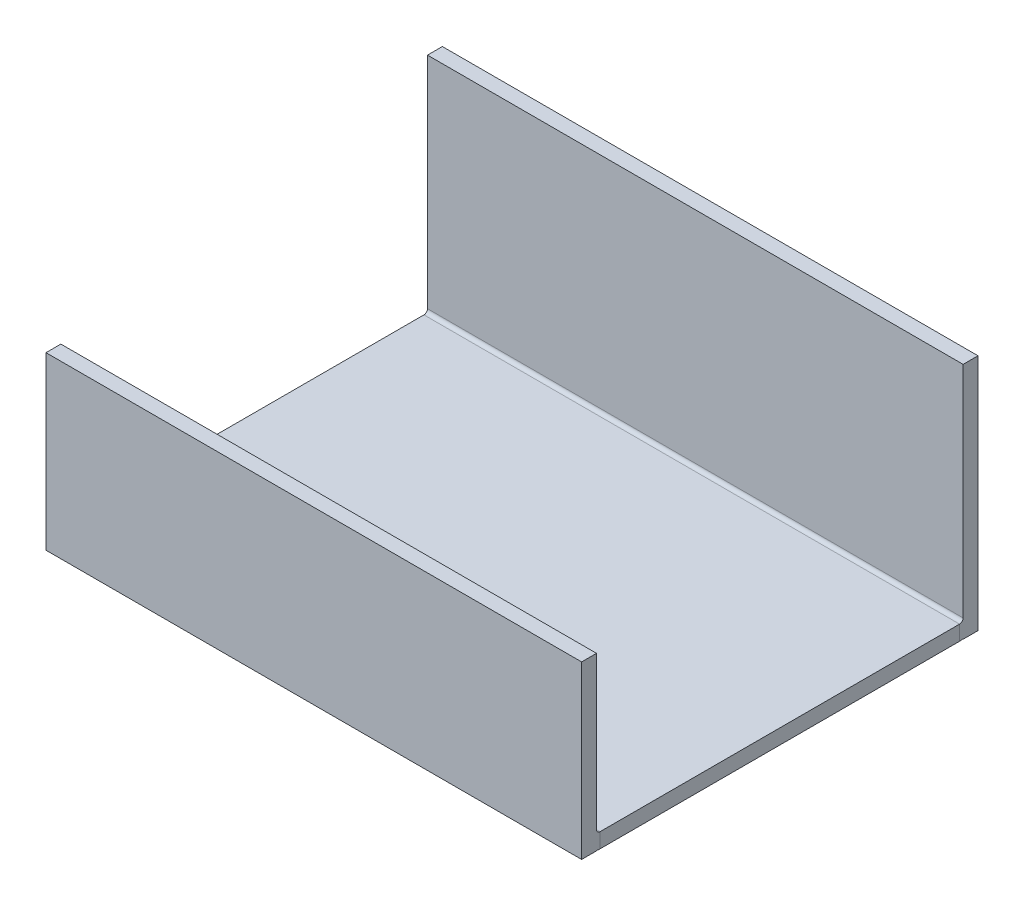
ISO-10303-21;
HEADER;
FILE_DESCRIPTION(('STEP AP214'),'2;1');
FILE_NAME('part.step','',(''),(''),'','','');
FILE_SCHEMA(('AUTOMOTIVE_DESIGN { 1 0 10303 214 1 1 1 1 }'));
ENDSEC;
DATA;
#1=APPLICATION_CONTEXT('core data for automotive mechanical design processes');
#2=APPLICATION_PROTOCOL_DEFINITION('international standard','automotive_design',2000,#1);
#3=PRODUCT_CONTEXT('',#1,'mechanical');
#4=PRODUCT('Part','Part','',(#3));
#5=PRODUCT_RELATED_PRODUCT_CATEGORY('part','',(#4));
#6=PRODUCT_DEFINITION_FORMATION('','',#4);
#7=PRODUCT_DEFINITION_CONTEXT('part definition',#1,'design');
#8=PRODUCT_DEFINITION('design','',#6,#7);
#9=PRODUCT_DEFINITION_SHAPE('','',#8);
#10=(LENGTH_UNIT() NAMED_UNIT(*) SI_UNIT(.MILLI.,.METRE.));
#11=(NAMED_UNIT(*) PLANE_ANGLE_UNIT() SI_UNIT($,.RADIAN.));
#12=(NAMED_UNIT(*) SI_UNIT($,.STERADIAN.) SOLID_ANGLE_UNIT());
#13=UNCERTAINTY_MEASURE_WITH_UNIT(LENGTH_MEASURE(1.E-05),#10,'distance_accuracy_value','');
#14=(GEOMETRIC_REPRESENTATION_CONTEXT(3) GLOBAL_UNCERTAINTY_ASSIGNED_CONTEXT((#13)) GLOBAL_UNIT_ASSIGNED_CONTEXT((#10,
#11,#12)) REPRESENTATION_CONTEXT('',''));
#15=CARTESIAN_POINT('',(0.,0.,0.));
#16=DIRECTION('',(0.,0.,1.));
#17=DIRECTION('',(1.,0.,0.));
#18=AXIS2_PLACEMENT_3D('',#15,#16,#17);
#19=CARTESIAN_POINT('',(0.,3.175,-78.232));
#20=DIRECTION('',(0.,-1.,0.));
#21=DIRECTION('',(0.,0.,-1.));
#22=AXIS2_PLACEMENT_3D('',#19,#20,#21);
#23=PLANE('',#22);
#24=DIRECTION('',(1.,0.,0.));
#25=VECTOR('',#24,1.);
#26=CARTESIAN_POINT('',(114.3,3.175,-0.761999999999999));
#27=LINE('',#26,#25);
#28=CARTESIAN_POINT('',(114.3,3.175,-0.761999999999999));
#29=VERTEX_POINT('',#28);
#30=CARTESIAN_POINT('',(0.,3.175,-0.761999999999999));
#31=VERTEX_POINT('',#30);
#32=EDGE_CURVE('E248',#29,#31,#27,.F.);
#33=ORIENTED_EDGE('',*,*,#32,.F.);
#34=DIRECTION('',(0.,0.,-1.));
#35=VECTOR('',#34,1.);
#36=CARTESIAN_POINT('',(114.3,3.175,0.));
#37=LINE('',#36,#35);
#38=CARTESIAN_POINT('',(114.3,3.17499999999999,-77.47));
#39=VERTEX_POINT('',#38);
#40=EDGE_CURVE('E11',#29,#39,#37,.T.);
#41=ORIENTED_EDGE('',*,*,#40,.T.);
#42=DIRECTION('',(-1.,0.,0.));
#43=VECTOR('',#42,1.);
#44=CARTESIAN_POINT('',(0.,3.17499999999999,-77.47));
#45=LINE('',#44,#43);
#46=CARTESIAN_POINT('',(0.,3.17499999999999,-77.47));
#47=VERTEX_POINT('',#46);
#48=EDGE_CURVE('E277',#47,#39,#45,.F.);
#49=ORIENTED_EDGE('',*,*,#48,.F.);
#50=DIRECTION('',(0.,0.,1.));
#51=VECTOR('',#50,1.);
#52=CARTESIAN_POINT('',(0.,3.175,0.));
#53=LINE('',#52,#51);
#54=EDGE_CURVE('E48',#47,#31,#53,.T.);
#55=ORIENTED_EDGE('',*,*,#54,.T.);
#56=EDGE_LOOP('',(#33,#41,#49,#55));
#57=FACE_BOUND('',#56,.T.);
#58=ADVANCED_FACE('F39',(#57),#23,.F.);
#59=CARTESIAN_POINT('',(0.,0.,-78.232));
#60=DIRECTION('',(0.,-1.,0.));
#61=DIRECTION('',(0.,0.,-1.));
#62=AXIS2_PLACEMENT_3D('',#59,#60,#61);
#63=PLANE('',#62);
#64=DIRECTION('',(0.,0.,-1.));
#65=VECTOR('',#64,1.);
#66=CARTESIAN_POINT('',(114.3,0.,-78.232));
#67=LINE('',#66,#65);
#68=CARTESIAN_POINT('',(114.3,0.,-0.761999999999998));
#69=VERTEX_POINT('',#68);
#70=CARTESIAN_POINT('',(114.3,0.,-77.47));
#71=VERTEX_POINT('',#70);
#72=EDGE_CURVE('E43',#69,#71,#67,.T.);
#73=ORIENTED_EDGE('',*,*,#72,.F.);
#74=DIRECTION('',(1.,0.,0.));
#75=VECTOR('',#74,1.);
#76=CARTESIAN_POINT('',(114.3,0.,-0.761999999999998));
#77=LINE('',#76,#75);
#78=CARTESIAN_POINT('',(0.,0.,-0.761999999999998));
#79=VERTEX_POINT('',#78);
#80=EDGE_CURVE('E236',#69,#79,#77,.F.);
#81=ORIENTED_EDGE('',*,*,#80,.T.);
#82=DIRECTION('',(0.,0.,-1.));
#83=VECTOR('',#82,1.);
#84=CARTESIAN_POINT('',(0.,0.,-78.232));
#85=LINE('',#84,#83);
#86=CARTESIAN_POINT('',(0.,0.,-77.47));
#87=VERTEX_POINT('',#86);
#88=EDGE_CURVE('E284',#87,#79,#85,.F.);
#89=ORIENTED_EDGE('',*,*,#88,.F.);
#90=DIRECTION('',(-1.,0.,0.));
#91=VECTOR('',#90,1.);
#92=CARTESIAN_POINT('',(0.,0.,-77.47));
#93=LINE('',#92,#91);
#94=EDGE_CURVE('E268',#87,#71,#93,.F.);
#95=ORIENTED_EDGE('',*,*,#94,.T.);
#96=EDGE_LOOP('',(#73,#81,#89,#95));
#97=FACE_BOUND('',#96,.T.);
#98=ADVANCED_FACE('F299',(#97),#63,.T.);
#99=CARTESIAN_POINT('',(114.3,3.175,0.));
#100=DIRECTION('',(-1.,0.,0.));
#101=DIRECTION('',(0.,0.,-1.));
#102=AXIS2_PLACEMENT_3D('',#99,#100,#101);
#103=PLANE('',#102);
#104=ORIENTED_EDGE('',*,*,#40,.F.);
#105=DIRECTION('',(0.,-1.,0.));
#106=VECTOR('',#105,1.);
#107=CARTESIAN_POINT('',(114.3,3.175,-0.761999999999999));
#108=LINE('',#107,#106);
#109=EDGE_CURVE('E243',#29,#69,#108,.T.);
#110=ORIENTED_EDGE('',*,*,#109,.T.);
#111=ORIENTED_EDGE('',*,*,#72,.T.);
#112=DIRECTION('',(0.,-1.,0.));
#113=VECTOR('',#112,1.);
#114=CARTESIAN_POINT('',(114.3,3.17499999999999,-77.47));
#115=LINE('',#114,#113);
#116=EDGE_CURVE('E282',#39,#71,#115,.T.);
#117=ORIENTED_EDGE('',*,*,#116,.F.);
#118=EDGE_LOOP('',(#104,#110,#111,#117));
#119=FACE_BOUND('',#118,.T.);
#120=ADVANCED_FACE('F41',(#119),#103,.F.);
#121=CARTESIAN_POINT('',(0.,3.175,0.));
#122=DIRECTION('',(1.,0.,0.));
#123=DIRECTION('',(0.,0.,1.));
#124=AXIS2_PLACEMENT_3D('',#121,#122,#123);
#125=PLANE('',#124);
#126=DIRECTION('',(0.,-1.,0.));
#127=VECTOR('',#126,1.);
#128=CARTESIAN_POINT('',(0.,3.175,-0.761999999999999));
#129=LINE('',#128,#127);
#130=EDGE_CURVE('E252',#31,#79,#129,.T.);
#131=ORIENTED_EDGE('',*,*,#130,.F.);
#132=ORIENTED_EDGE('',*,*,#54,.F.);
#133=DIRECTION('',(0.,-1.,0.));
#134=VECTOR('',#133,1.);
#135=CARTESIAN_POINT('',(0.,3.17499999999999,-77.47));
#136=LINE('',#135,#134);
#137=EDGE_CURVE('E272',#47,#87,#136,.T.);
#138=ORIENTED_EDGE('',*,*,#137,.T.);
#139=ORIENTED_EDGE('',*,*,#88,.T.);
#140=EDGE_LOOP('',(#131,#132,#138,#139));
#141=FACE_BOUND('',#140,.T.);
#142=ADVANCED_FACE('F308',(#141),#125,.F.);
#143=CARTESIAN_POINT('',(114.3,3.93699999999999,-77.47));
#144=DIRECTION('',(1.,0.,0.));
#145=DIRECTION('',(0.,0.,-1.));
#146=AXIS2_PLACEMENT_3D('',#143,#144,#145);
#147=PLANE('',#146);
#148=CARTESIAN_POINT('',(114.3,3.93699999999999,-77.47));
#149=DIRECTION('',(-1.,0.,0.));
#150=DIRECTION('',(0.,0.,1.));
#151=AXIS2_PLACEMENT_3D('',#148,#149,#150);
#152=CIRCLE('',#151,3.937);
#153=CARTESIAN_POINT('',(114.3,0.0744457932606198,-78.232));
#154=VERTEX_POINT('',#153);
#155=EDGE_CURVE('E158',#71,#154,#152,.F.);
#156=ORIENTED_EDGE('',*,*,#155,.T.);
#157=DIRECTION('',(0.,-1.,0.));
#158=VECTOR('',#157,1.);
#159=CARTESIAN_POINT('',(114.3,0.,-78.232));
#160=LINE('',#159,#158);
#161=CARTESIAN_POINT('',(114.3,0.,-78.232));
#162=VERTEX_POINT('',#161);
#163=EDGE_CURVE('E152',#154,#162,#160,.T.);
#164=ORIENTED_EDGE('',*,*,#163,.T.);
#165=DIRECTION('',(0.,0.,-1.));
#166=VECTOR('',#165,1.);
#167=CARTESIAN_POINT('',(114.3,0.,-78.232));
#168=LINE('',#167,#166);
#169=CARTESIAN_POINT('',(114.3,0.,-81.407));
#170=VERTEX_POINT('',#169);
#171=EDGE_CURVE('E155',#162,#170,#168,.T.);
#172=ORIENTED_EDGE('',*,*,#171,.T.);
#173=DIRECTION('',(0.,-1.,0.));
#174=VECTOR('',#173,1.);
#175=CARTESIAN_POINT('',(114.3,3.17499999999999,-81.407));
#176=LINE('',#175,#174);
#177=CARTESIAN_POINT('',(114.3,50.8,-81.4070000000002));
#178=VERTEX_POINT('',#177);
#179=EDGE_CURVE('E260',#178,#170,#176,.T.);
#180=ORIENTED_EDGE('',*,*,#179,.F.);
#181=DIRECTION('',(0.,0.,-1.));
#182=VECTOR('',#181,1.);
#183=CARTESIAN_POINT('',(114.3,50.8,-78.2320000000002));
#184=LINE('',#183,#182);
#185=CARTESIAN_POINT('',(114.3,50.8,-78.2320000000002));
#186=VERTEX_POINT('',#185);
#187=EDGE_CURVE('E185',#186,#178,#184,.T.);
#188=ORIENTED_EDGE('',*,*,#187,.F.);
#189=DIRECTION('',(0.,-1.,0.));
#190=VECTOR('',#189,1.);
#191=CARTESIAN_POINT('',(114.3,3.175,-78.232));
#192=LINE('',#191,#190);
#193=CARTESIAN_POINT('',(114.3,3.93699999999999,-78.232));
#194=VERTEX_POINT('',#193);
#195=EDGE_CURVE('E259',#186,#194,#192,.T.);
#196=ORIENTED_EDGE('',*,*,#195,.T.);
#197=CARTESIAN_POINT('',(114.3,3.93699999999999,-77.47));
#198=DIRECTION('',(-1.,0.,0.));
#199=DIRECTION('',(0.,0.,1.));
#200=AXIS2_PLACEMENT_3D('',#197,#198,#199);
#201=CIRCLE('',#200,0.761999999999999);
#202=EDGE_CURVE('E274',#39,#194,#201,.F.);
#203=ORIENTED_EDGE('',*,*,#202,.F.);
#204=ORIENTED_EDGE('',*,*,#116,.T.);
#205=EDGE_LOOP('',(#156,#164,#172,#180,#188,#196,#203,#204));
#206=FACE_BOUND('',#205,.T.);
#207=ADVANCED_FACE('F154',(#206),#147,.T.);
#208=CARTESIAN_POINT('',(0.,3.93699999999999,-77.47));
#209=DIRECTION('',(1.,0.,0.));
#210=DIRECTION('',(0.,0.,-1.));
#211=AXIS2_PLACEMENT_3D('',#208,#209,#210);
#212=PLANE('',#211);
#213=CARTESIAN_POINT('',(0.,3.93699999999999,-77.47));
#214=DIRECTION('',(-1.,0.,0.));
#215=DIRECTION('',(0.,0.,1.));
#216=AXIS2_PLACEMENT_3D('',#213,#214,#215);
#217=CIRCLE('',#216,0.761999999999999);
#218=CARTESIAN_POINT('',(0.,3.93699999999999,-78.232));
#219=VERTEX_POINT('',#218);
#220=EDGE_CURVE('E265',#219,#47,#217,.T.);
#221=ORIENTED_EDGE('',*,*,#220,.F.);
#222=DIRECTION('',(0.,1.,0.));
#223=VECTOR('',#222,1.);
#224=CARTESIAN_POINT('',(0.,26.543,-78.2320000000001));
#225=LINE('',#224,#223);
#226=CARTESIAN_POINT('',(0.,50.8,-78.2320000000002));
#227=VERTEX_POINT('',#226);
#228=EDGE_CURVE('E263',#219,#227,#225,.T.);
#229=ORIENTED_EDGE('',*,*,#228,.T.);
#230=DIRECTION('',(0.,0.,-1.));
#231=VECTOR('',#230,1.);
#232=CARTESIAN_POINT('',(0.,50.8,-78.2320000000002));
#233=LINE('',#232,#231);
#234=CARTESIAN_POINT('',(0.,50.8,-81.4070000000002));
#235=VERTEX_POINT('',#234);
#236=EDGE_CURVE('E188',#227,#235,#233,.T.);
#237=ORIENTED_EDGE('',*,*,#236,.T.);
#238=DIRECTION('',(0.,1.,0.));
#239=VECTOR('',#238,1.);
#240=CARTESIAN_POINT('',(0.,26.543,-81.4070000000001));
#241=LINE('',#240,#239);
#242=CARTESIAN_POINT('',(0.,0.,-81.407));
#243=VERTEX_POINT('',#242);
#244=EDGE_CURVE('E262',#243,#235,#241,.T.);
#245=ORIENTED_EDGE('',*,*,#244,.F.);
#246=DIRECTION('',(0.,0.,-1.));
#247=VECTOR('',#246,1.);
#248=CARTESIAN_POINT('',(0.,0.,-78.232));
#249=LINE('',#248,#247);
#250=CARTESIAN_POINT('',(0.,0.,-78.232));
#251=VERTEX_POINT('',#250);
#252=EDGE_CURVE('E170',#251,#243,#249,.T.);
#253=ORIENTED_EDGE('',*,*,#252,.F.);
#254=DIRECTION('',(0.,1.,0.));
#255=VECTOR('',#254,1.);
#256=CARTESIAN_POINT('',(0.,0.,-78.232));
#257=LINE('',#256,#255);
#258=CARTESIAN_POINT('',(0.,0.0744457932606198,-78.232));
#259=VERTEX_POINT('',#258);
#260=EDGE_CURVE('E176',#251,#259,#257,.T.);
#261=ORIENTED_EDGE('',*,*,#260,.T.);
#262=CARTESIAN_POINT('',(0.,3.93699999999999,-77.47));
#263=DIRECTION('',(-1.,0.,0.));
#264=DIRECTION('',(0.,0.,1.));
#265=AXIS2_PLACEMENT_3D('',#262,#263,#264);
#266=CIRCLE('',#265,3.937);
#267=EDGE_CURVE('E61',#259,#87,#266,.T.);
#268=ORIENTED_EDGE('',*,*,#267,.T.);
#269=ORIENTED_EDGE('',*,*,#137,.F.);
#270=EDGE_LOOP('',(#221,#229,#237,#245,#253,#261,#268,#269));
#271=FACE_BOUND('',#270,.T.);
#272=ADVANCED_FACE('F318',(#271),#212,.F.);
#273=CARTESIAN_POINT('',(0.,3.93699999999999,-77.47));
#274=DIRECTION('',(-1.,0.,0.));
#275=DIRECTION('',(0.,0.,-1.));
#276=AXIS2_PLACEMENT_3D('',#273,#274,#275);
#277=CYLINDRICAL_SURFACE('',#276,3.937);
#278=DIRECTION('',(-1.,0.,0.));
#279=VECTOR('',#278,1.);
#280=CARTESIAN_POINT('',(0.,0.0744457932606198,-78.232));
#281=LINE('',#280,#279);
#282=EDGE_CURVE('E56',#154,#259,#281,.T.);
#283=ORIENTED_EDGE('',*,*,#282,.F.);
#284=ORIENTED_EDGE('',*,*,#155,.F.);
#285=ORIENTED_EDGE('',*,*,#94,.F.);
#286=ORIENTED_EDGE('',*,*,#267,.F.);
#287=EDGE_LOOP('',(#283,#284,#285,#286));
#288=FACE_BOUND('',#287,.T.);
#289=ADVANCED_FACE('F297',(#288),#277,.T.);
#290=CARTESIAN_POINT('',(0.,3.93699999999999,-77.47));
#291=DIRECTION('',(-1.,0.,0.));
#292=DIRECTION('',(0.,0.,-1.));
#293=AXIS2_PLACEMENT_3D('',#290,#291,#292);
#294=CYLINDRICAL_SURFACE('',#293,0.761999999999999);
#295=ORIENTED_EDGE('',*,*,#48,.T.);
#296=ORIENTED_EDGE('',*,*,#202,.T.);
#297=DIRECTION('',(-1.,0.,0.));
#298=VECTOR('',#297,1.);
#299=CARTESIAN_POINT('',(114.3,3.937,-78.232));
#300=LINE('',#299,#298);
#301=EDGE_CURVE('E255',#194,#219,#300,.T.);
#302=ORIENTED_EDGE('',*,*,#301,.T.);
#303=ORIENTED_EDGE('',*,*,#220,.T.);
#304=EDGE_LOOP('',(#295,#296,#302,#303));
#305=FACE_BOUND('',#304,.T.);
#306=ADVANCED_FACE('F313',(#305),#294,.F.);
#307=CARTESIAN_POINT('',(114.3,26.543,-81.4070000000001));
#308=DIRECTION('',(0.,0.,1.));
#309=DIRECTION('',(0.,-1.,0.));
#310=AXIS2_PLACEMENT_3D('',#307,#308,#309);
#311=PLANE('',#310);
#312=ORIENTED_EDGE('',*,*,#244,.T.);
#313=DIRECTION('',(1.,0.,0.));
#314=VECTOR('',#313,1.);
#315=CARTESIAN_POINT('',(114.3,50.8,-81.4070000000002));
#316=LINE('',#315,#314);
#317=EDGE_CURVE('E162',#235,#178,#316,.T.);
#318=ORIENTED_EDGE('',*,*,#317,.T.);
#319=ORIENTED_EDGE('',*,*,#179,.T.);
#320=DIRECTION('',(-1.,0.,0.));
#321=VECTOR('',#320,1.);
#322=CARTESIAN_POINT('',(114.3,0.,-81.407));
#323=LINE('',#322,#321);
#324=EDGE_CURVE('E169',#170,#243,#323,.T.);
#325=ORIENTED_EDGE('',*,*,#324,.T.);
#326=EDGE_LOOP('',(#312,#318,#319,#325));
#327=FACE_BOUND('',#326,.T.);
#328=ADVANCED_FACE('F328',(#327),#311,.F.);
#329=CARTESIAN_POINT('',(114.3,26.543,-78.2320000000001));
#330=DIRECTION('',(0.,0.,1.));
#331=DIRECTION('',(0.,-1.,0.));
#332=AXIS2_PLACEMENT_3D('',#329,#330,#331);
#333=PLANE('',#332);
#334=DIRECTION('',(1.,0.,0.));
#335=VECTOR('',#334,1.);
#336=CARTESIAN_POINT('',(114.3,50.8,-78.2320000000002));
#337=LINE('',#336,#335);
#338=EDGE_CURVE('E171',#227,#186,#337,.T.);
#339=ORIENTED_EDGE('',*,*,#338,.F.);
#340=ORIENTED_EDGE('',*,*,#228,.F.);
#341=ORIENTED_EDGE('',*,*,#301,.F.);
#342=ORIENTED_EDGE('',*,*,#195,.F.);
#343=EDGE_LOOP('',(#339,#340,#341,#342));
#344=FACE_BOUND('',#343,.T.);
#345=ADVANCED_FACE('F322',(#344),#333,.T.);
#346=CARTESIAN_POINT('',(0.,3.937,-0.761999999999999));
#347=DIRECTION('',(-1.,0.,0.));
#348=DIRECTION('',(0.,0.,1.));
#349=AXIS2_PLACEMENT_3D('',#346,#347,#348);
#350=PLANE('',#349);
#351=CARTESIAN_POINT('',(0.,3.937,-0.761999999999999));
#352=DIRECTION('',(1.,0.,0.));
#353=DIRECTION('',(0.,0.,-1.));
#354=AXIS2_PLACEMENT_3D('',#351,#352,#353);
#355=CIRCLE('',#354,3.937);
#356=CARTESIAN_POINT('',(0.,0.0744457932606293,0.));
#357=VERTEX_POINT('',#356);
#358=EDGE_CURVE('E239',#79,#357,#355,.F.);
#359=ORIENTED_EDGE('',*,*,#358,.T.);
#360=DIRECTION('',(0.,-1.,0.));
#361=VECTOR('',#360,1.);
#362=CARTESIAN_POINT('',(0.,0.,0.));
#363=LINE('',#362,#361);
#364=CARTESIAN_POINT('',(0.,0.,0.));
#365=VERTEX_POINT('',#364);
#366=EDGE_CURVE('E194',#357,#365,#363,.T.);
#367=ORIENTED_EDGE('',*,*,#366,.T.);
#368=DIRECTION('',(0.,0.,1.));
#369=VECTOR('',#368,1.);
#370=CARTESIAN_POINT('',(0.,0.,0.));
#371=LINE('',#370,#369);
#372=CARTESIAN_POINT('',(0.,0.,3.175));
#373=VERTEX_POINT('',#372);
#374=EDGE_CURVE('E206',#365,#373,#371,.T.);
#375=ORIENTED_EDGE('',*,*,#374,.T.);
#376=DIRECTION('',(0.,-1.,0.));
#377=VECTOR('',#376,1.);
#378=CARTESIAN_POINT('',(0.,3.175,3.175));
#379=LINE('',#378,#377);
#380=CARTESIAN_POINT('',(0.,36.5125,3.175));
#381=VERTEX_POINT('',#380);
#382=EDGE_CURVE('E228',#381,#373,#379,.T.);
#383=ORIENTED_EDGE('',*,*,#382,.F.);
#384=DIRECTION('',(0.,0.,1.));
#385=VECTOR('',#384,1.);
#386=CARTESIAN_POINT('',(0.,36.5125,0.));
#387=LINE('',#386,#385);
#388=CARTESIAN_POINT('',(0.,36.5125,0.));
#389=VERTEX_POINT('',#388);
#390=EDGE_CURVE('E211',#389,#381,#387,.T.);
#391=ORIENTED_EDGE('',*,*,#390,.F.);
#392=DIRECTION('',(0.,-1.,0.));
#393=VECTOR('',#392,1.);
#394=CARTESIAN_POINT('',(0.,3.175,0.));
#395=LINE('',#394,#393);
#396=CARTESIAN_POINT('',(0.,3.937,0.));
#397=VERTEX_POINT('',#396);
#398=EDGE_CURVE('E227',#389,#397,#395,.T.);
#399=ORIENTED_EDGE('',*,*,#398,.T.);
#400=CARTESIAN_POINT('',(0.,3.937,-0.761999999999999));
#401=DIRECTION('',(1.,0.,0.));
#402=DIRECTION('',(0.,0.,-1.));
#403=AXIS2_PLACEMENT_3D('',#400,#401,#402);
#404=CIRCLE('',#403,0.761999999999999);
#405=EDGE_CURVE('E245',#31,#397,#404,.F.);
#406=ORIENTED_EDGE('',*,*,#405,.F.);
#407=ORIENTED_EDGE('',*,*,#130,.T.);
#408=EDGE_LOOP('',(#359,#367,#375,#383,#391,#399,#406,#407));
#409=FACE_BOUND('',#408,.T.);
#410=ADVANCED_FACE('F306',(#409),#350,.T.);
#411=CARTESIAN_POINT('',(114.3,3.937,-0.761999999999999));
#412=DIRECTION('',(-1.,0.,0.));
#413=DIRECTION('',(0.,0.,1.));
#414=AXIS2_PLACEMENT_3D('',#411,#412,#413);
#415=PLANE('',#414);
#416=CARTESIAN_POINT('',(114.3,3.937,-0.761999999999999));
#417=DIRECTION('',(1.,0.,0.));
#418=DIRECTION('',(0.,0.,-1.));
#419=AXIS2_PLACEMENT_3D('',#416,#417,#418);
#420=CIRCLE('',#419,0.761999999999999);
#421=CARTESIAN_POINT('',(114.3,3.937,0.));
#422=VERTEX_POINT('',#421);
#423=EDGE_CURVE('E233',#422,#29,#420,.T.);
#424=ORIENTED_EDGE('',*,*,#423,.F.);
#425=DIRECTION('',(0.,1.,0.));
#426=VECTOR('',#425,1.);
#427=CARTESIAN_POINT('',(114.3,26.543,0.));
#428=LINE('',#427,#426);
#429=CARTESIAN_POINT('',(114.3,36.5125,0.));
#430=VERTEX_POINT('',#429);
#431=EDGE_CURVE('E231',#422,#430,#428,.T.);
#432=ORIENTED_EDGE('',*,*,#431,.T.);
#433=DIRECTION('',(0.,0.,1.));
#434=VECTOR('',#433,1.);
#435=CARTESIAN_POINT('',(114.3,36.5125,0.));
#436=LINE('',#435,#434);
#437=CARTESIAN_POINT('',(114.3,36.5125,3.175));
#438=VERTEX_POINT('',#437);
#439=EDGE_CURVE('E215',#430,#438,#436,.T.);
#440=ORIENTED_EDGE('',*,*,#439,.T.);
#441=DIRECTION('',(0.,1.,0.));
#442=VECTOR('',#441,1.);
#443=CARTESIAN_POINT('',(114.3,26.543,3.175));
#444=LINE('',#443,#442);
#445=CARTESIAN_POINT('',(114.3,0.,3.175));
#446=VERTEX_POINT('',#445);
#447=EDGE_CURVE('E230',#446,#438,#444,.T.);
#448=ORIENTED_EDGE('',*,*,#447,.F.);
#449=DIRECTION('',(0.,0.,1.));
#450=VECTOR('',#449,1.);
#451=CARTESIAN_POINT('',(114.3,0.,0.));
#452=LINE('',#451,#450);
#453=CARTESIAN_POINT('',(114.3,0.,0.));
#454=VERTEX_POINT('',#453);
#455=EDGE_CURVE('E218',#454,#446,#452,.T.);
#456=ORIENTED_EDGE('',*,*,#455,.F.);
#457=DIRECTION('',(0.,1.,0.));
#458=VECTOR('',#457,1.);
#459=CARTESIAN_POINT('',(114.3,0.,0.));
#460=LINE('',#459,#458);
#461=CARTESIAN_POINT('',(114.3,0.0744457932606293,0.));
#462=VERTEX_POINT('',#461);
#463=EDGE_CURVE('E200',#454,#462,#460,.T.);
#464=ORIENTED_EDGE('',*,*,#463,.T.);
#465=CARTESIAN_POINT('',(114.3,3.937,-0.761999999999999));
#466=DIRECTION('',(1.,0.,0.));
#467=DIRECTION('',(0.,0.,-1.));
#468=AXIS2_PLACEMENT_3D('',#465,#466,#467);
#469=CIRCLE('',#468,3.937);
#470=EDGE_CURVE('E240',#462,#69,#469,.T.);
#471=ORIENTED_EDGE('',*,*,#470,.T.);
#472=ORIENTED_EDGE('',*,*,#109,.F.);
#473=EDGE_LOOP('',(#424,#432,#440,#448,#456,#464,#471,#472));
#474=FACE_BOUND('',#473,.T.);
#475=ADVANCED_FACE('F388',(#474),#415,.F.);
#476=CARTESIAN_POINT('',(114.3,3.937,-0.761999999999999));
#477=DIRECTION('',(1.,0.,0.));
#478=DIRECTION('',(0.,0.,1.));
#479=AXIS2_PLACEMENT_3D('',#476,#477,#478);
#480=CYLINDRICAL_SURFACE('',#479,3.937);
#481=DIRECTION('',(1.,0.,0.));
#482=VECTOR('',#481,1.);
#483=CARTESIAN_POINT('',(114.3,0.0744457932606293,0.));
#484=LINE('',#483,#482);
#485=EDGE_CURVE('E214',#357,#462,#484,.T.);
#486=ORIENTED_EDGE('',*,*,#485,.F.);
#487=ORIENTED_EDGE('',*,*,#358,.F.);
#488=ORIENTED_EDGE('',*,*,#80,.F.);
#489=ORIENTED_EDGE('',*,*,#470,.F.);
#490=EDGE_LOOP('',(#486,#487,#488,#489));
#491=FACE_BOUND('',#490,.T.);
#492=ADVANCED_FACE('F302',(#491),#480,.T.);
#493=CARTESIAN_POINT('',(114.3,3.937,-0.761999999999999));
#494=DIRECTION('',(1.,0.,0.));
#495=DIRECTION('',(0.,0.,1.));
#496=AXIS2_PLACEMENT_3D('',#493,#494,#495);
#497=CYLINDRICAL_SURFACE('',#496,0.761999999999999);
#498=ORIENTED_EDGE('',*,*,#32,.T.);
#499=ORIENTED_EDGE('',*,*,#405,.T.);
#500=DIRECTION('',(1.,0.,0.));
#501=VECTOR('',#500,1.);
#502=CARTESIAN_POINT('',(0.,3.937,0.));
#503=LINE('',#502,#501);
#504=EDGE_CURVE('E225',#397,#422,#503,.T.);
#505=ORIENTED_EDGE('',*,*,#504,.T.);
#506=ORIENTED_EDGE('',*,*,#423,.T.);
#507=EDGE_LOOP('',(#498,#499,#505,#506));
#508=FACE_BOUND('',#507,.T.);
#509=ADVANCED_FACE('F387',(#508),#497,.F.);
#510=CARTESIAN_POINT('',(0.,26.543,3.175));
#511=DIRECTION('',(0.,0.,-1.));
#512=DIRECTION('',(-1.,0.,0.));
#513=AXIS2_PLACEMENT_3D('',#510,#511,#512);
#514=PLANE('',#513);
#515=DIRECTION('',(-1.,0.,0.));
#516=VECTOR('',#515,1.);
#517=CARTESIAN_POINT('',(0.,36.5125,3.175));
#518=LINE('',#517,#516);
#519=EDGE_CURVE('E197',#438,#381,#518,.T.);
#520=ORIENTED_EDGE('',*,*,#519,.T.);
#521=ORIENTED_EDGE('',*,*,#382,.T.);
#522=DIRECTION('',(1.,0.,0.));
#523=VECTOR('',#522,1.);
#524=CARTESIAN_POINT('',(0.,0.,3.175));
#525=LINE('',#524,#523);
#526=EDGE_CURVE('E193',#373,#446,#525,.T.);
#527=ORIENTED_EDGE('',*,*,#526,.T.);
#528=ORIENTED_EDGE('',*,*,#447,.T.);
#529=EDGE_LOOP('',(#520,#521,#527,#528));
#530=FACE_BOUND('',#529,.T.);
#531=ADVANCED_FACE('F400',(#530),#514,.F.);
#532=CARTESIAN_POINT('',(0.,26.543,0.));
#533=DIRECTION('',(0.,0.,-1.));
#534=DIRECTION('',(-1.,0.,0.));
#535=AXIS2_PLACEMENT_3D('',#532,#533,#534);
#536=PLANE('',#535);
#537=ORIENTED_EDGE('',*,*,#398,.F.);
#538=DIRECTION('',(-1.,0.,0.));
#539=VECTOR('',#538,1.);
#540=CARTESIAN_POINT('',(0.,36.5125,0.));
#541=LINE('',#540,#539);
#542=EDGE_CURVE('E203',#430,#389,#541,.T.);
#543=ORIENTED_EDGE('',*,*,#542,.F.);
#544=ORIENTED_EDGE('',*,*,#431,.F.);
#545=ORIENTED_EDGE('',*,*,#504,.F.);
#546=EDGE_LOOP('',(#537,#543,#544,#545));
#547=FACE_BOUND('',#546,.T.);
#548=ADVANCED_FACE('F465',(#547),#536,.T.);
#549=CARTESIAN_POINT('',(0.,36.5125,0.));
#550=DIRECTION('',(0.,1.,0.));
#551=DIRECTION('',(0.,0.,1.));
#552=AXIS2_PLACEMENT_3D('',#549,#550,#551);
#553=PLANE('',#552);
#554=ORIENTED_EDGE('',*,*,#519,.F.);
#555=ORIENTED_EDGE('',*,*,#439,.F.);
#556=ORIENTED_EDGE('',*,*,#542,.T.);
#557=ORIENTED_EDGE('',*,*,#390,.T.);
#558=EDGE_LOOP('',(#554,#555,#556,#557));
#559=FACE_BOUND('',#558,.T.);
#560=ADVANCED_FACE('F461',(#559),#553,.T.);
#561=CARTESIAN_POINT('',(0.,0.,0.));
#562=DIRECTION('',(0.,0.,-1.));
#563=DIRECTION('',(-1.,0.,0.));
#564=AXIS2_PLACEMENT_3D('',#561,#562,#563);
#565=PLANE('',#564);
#566=ORIENTED_EDGE('',*,*,#366,.F.);
#567=ORIENTED_EDGE('',*,*,#485,.T.);
#568=ORIENTED_EDGE('',*,*,#463,.F.);
#569=DIRECTION('',(1.,0.,0.));
#570=VECTOR('',#569,1.);
#571=CARTESIAN_POINT('',(0.,0.,0.));
#572=LINE('',#571,#570);
#573=EDGE_CURVE('E196',#365,#454,#572,.T.);
#574=ORIENTED_EDGE('',*,*,#573,.F.);
#575=EDGE_LOOP('',(#566,#567,#568,#574));
#576=FACE_BOUND('',#575,.T.);
#577=ADVANCED_FACE('F458',(#576),#565,.T.);
#578=CARTESIAN_POINT('',(0.,0.,0.));
#579=DIRECTION('',(0.,-1.,0.));
#580=DIRECTION('',(0.,0.,-1.));
#581=AXIS2_PLACEMENT_3D('',#578,#579,#580);
#582=PLANE('',#581);
#583=ORIENTED_EDGE('',*,*,#526,.F.);
#584=ORIENTED_EDGE('',*,*,#374,.F.);
#585=ORIENTED_EDGE('',*,*,#573,.T.);
#586=ORIENTED_EDGE('',*,*,#455,.T.);
#587=EDGE_LOOP('',(#583,#584,#585,#586));
#588=FACE_BOUND('',#587,.T.);
#589=ADVANCED_FACE('F436',(#588),#582,.T.);
#590=CARTESIAN_POINT('',(114.3,50.8,-78.2320000000002));
#591=DIRECTION('',(0.,1.,0.));
#592=DIRECTION('',(0.,0.,1.));
#593=AXIS2_PLACEMENT_3D('',#590,#591,#592);
#594=PLANE('',#593);
#595=ORIENTED_EDGE('',*,*,#317,.F.);
#596=ORIENTED_EDGE('',*,*,#236,.F.);
#597=ORIENTED_EDGE('',*,*,#338,.T.);
#598=ORIENTED_EDGE('',*,*,#187,.T.);
#599=EDGE_LOOP('',(#595,#596,#597,#598));
#600=FACE_BOUND('',#599,.T.);
#601=ADVANCED_FACE('F326',(#600),#594,.T.);
#602=CARTESIAN_POINT('',(0.,-2.77795600532533E-13,-78.232));
#603=DIRECTION('',(0.,0.,1.));
#604=DIRECTION('',(0.,-1.,0.));
#605=AXIS2_PLACEMENT_3D('',#602,#603,#604);
#606=PLANE('',#605);
#607=ORIENTED_EDGE('',*,*,#163,.F.);
#608=ORIENTED_EDGE('',*,*,#282,.T.);
#609=ORIENTED_EDGE('',*,*,#260,.F.);
#610=DIRECTION('',(-1.,0.,0.));
#611=VECTOR('',#610,1.);
#612=CARTESIAN_POINT('',(114.3,0.,-78.232));
#613=LINE('',#612,#611);
#614=EDGE_CURVE('E161',#162,#251,#613,.T.);
#615=ORIENTED_EDGE('',*,*,#614,.F.);
#616=EDGE_LOOP('',(#607,#608,#609,#615));
#617=FACE_BOUND('',#616,.T.);
#618=ADVANCED_FACE('F174',(#617),#606,.T.);
#619=CARTESIAN_POINT('',(114.3,0.,-78.232));
#620=DIRECTION('',(0.,-1.,0.));
#621=DIRECTION('',(0.,0.,-1.));
#622=AXIS2_PLACEMENT_3D('',#619,#620,#621);
#623=PLANE('',#622);
#624=ORIENTED_EDGE('',*,*,#324,.F.);
#625=ORIENTED_EDGE('',*,*,#171,.F.);
#626=ORIENTED_EDGE('',*,*,#614,.T.);
#627=ORIENTED_EDGE('',*,*,#252,.T.);
#628=EDGE_LOOP('',(#624,#625,#626,#627));
#629=FACE_BOUND('',#628,.T.);
#630=ADVANCED_FACE('F166',(#629),#623,.T.);
#631=CLOSED_SHELL('',(#58,#98,#120,#142,#207,#272,#289,#306,#328,#345,#410,#475,#492,#509,#531,
#548,#560,#577,#589,#601,#618,#630));
#632=MANIFOLD_SOLID_BREP('B2',#631);
#633=ADVANCED_BREP_SHAPE_REPRESENTATION('',(#18,#632),#14);
#634=SHAPE_DEFINITION_REPRESENTATION(#9,#633);
ENDSEC;
END-ISO-10303-21;
